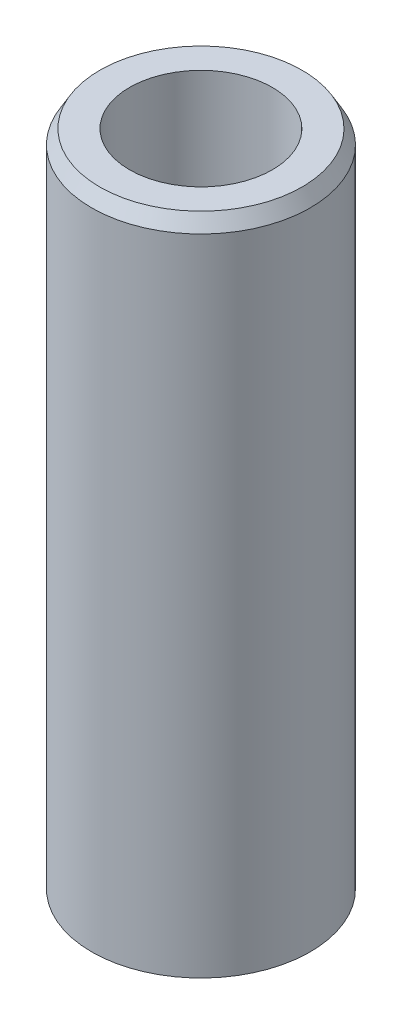
ISO-10303-21;
HEADER;
FILE_DESCRIPTION(('STEP AP214'),'2;1');
FILE_NAME('part.step','',(''),(''),'','','');
FILE_SCHEMA(('AUTOMOTIVE_DESIGN { 1 0 10303 214 1 1 1 1 }'));
ENDSEC;
DATA;
#1=APPLICATION_CONTEXT('core data for automotive mechanical design processes');
#2=APPLICATION_PROTOCOL_DEFINITION('international standard','automotive_design',2000,#1);
#3=PRODUCT_CONTEXT('',#1,'mechanical');
#4=PRODUCT('Part','Part','',(#3));
#5=PRODUCT_RELATED_PRODUCT_CATEGORY('part','',(#4));
#6=PRODUCT_DEFINITION_FORMATION('','',#4);
#7=PRODUCT_DEFINITION_CONTEXT('part definition',#1,'design');
#8=PRODUCT_DEFINITION('design','',#6,#7);
#9=PRODUCT_DEFINITION_SHAPE('','',#8);
#10=(LENGTH_UNIT() NAMED_UNIT(*) SI_UNIT(.MILLI.,.METRE.));
#11=(NAMED_UNIT(*) PLANE_ANGLE_UNIT() SI_UNIT($,.RADIAN.));
#12=(NAMED_UNIT(*) SI_UNIT($,.STERADIAN.) SOLID_ANGLE_UNIT());
#13=UNCERTAINTY_MEASURE_WITH_UNIT(LENGTH_MEASURE(1.E-05),#10,'distance_accuracy_value','');
#14=(GEOMETRIC_REPRESENTATION_CONTEXT(3) GLOBAL_UNCERTAINTY_ASSIGNED_CONTEXT((#13)) GLOBAL_UNIT_ASSIGNED_CONTEXT((#10,
#11,#12)) REPRESENTATION_CONTEXT('',''));
#15=CARTESIAN_POINT('',(0.,0.,0.));
#16=DIRECTION('',(0.,0.,1.));
#17=DIRECTION('',(1.,0.,0.));
#18=AXIS2_PLACEMENT_3D('',#15,#16,#17);
#19=CARTESIAN_POINT('',(0.,213.468186097187,0.));
#20=DIRECTION('',(0.,-1.,0.));
#21=DIRECTION('',(0.,0.,-1.));
#22=AXIS2_PLACEMENT_3D('',#19,#20,#21);
#23=CYLINDRICAL_SURFACE('',#22,35.);
#24=CARTESIAN_POINT('',(0.,208.973136825571,0.));
#25=DIRECTION('',(0.,1.,0.));
#26=DIRECTION('',(0.,0.,1.));
#27=AXIS2_PLACEMENT_3D('',#24,#25,#26);
#28=CIRCLE('',#27,35.);
#29=CARTESIAN_POINT('',(0.,208.973136825571,35.));
#30=VERTEX_POINT('',#29);
#31=EDGE_CURVE('E50',#30,#30,#28,.F.);
#32=ORIENTED_EDGE('',*,*,#31,.T.);
#33=EDGE_LOOP('',(#32));
#34=FACE_BOUND('',#33,.T.);
#35=CARTESIAN_POINT('',(0.,2.59521790698833,0.));
#36=DIRECTION('',(0.,1.,0.));
#37=DIRECTION('',(0.,0.,1.));
#38=AXIS2_PLACEMENT_3D('',#35,#36,#37);
#39=CIRCLE('',#38,35.);
#40=CARTESIAN_POINT('',(0.,2.59521790698833,35.));
#41=VERTEX_POINT('',#40);
#42=EDGE_CURVE('E51',#41,#41,#39,.T.);
#43=ORIENTED_EDGE('',*,*,#42,.T.);
#44=EDGE_LOOP('',(#43));
#45=FACE_BOUND('',#44,.T.);
#46=ADVANCED_FACE('F39',(#34,#45),#23,.T.);
#47=CARTESIAN_POINT('',(0.,213.468186097187,0.));
#48=DIRECTION('',(0.,1.,0.));
#49=DIRECTION('',(0.,0.,1.));
#50=AXIS2_PLACEMENT_3D('',#47,#48,#49);
#51=PLANE('',#50);
#52=CARTESIAN_POINT('',(0.,213.468186097187,0.));
#53=DIRECTION('',(0.,1.,0.));
#54=DIRECTION('',(0.,0.,1.));
#55=AXIS2_PLACEMENT_3D('',#52,#53,#54);
#56=CIRCLE('',#55,32.4047820930116);
#57=CARTESIAN_POINT('',(0.,213.468186097187,32.4047820930116));
#58=VERTEX_POINT('',#57);
#59=EDGE_CURVE('E54',#58,#58,#56,.T.);
#60=ORIENTED_EDGE('',*,*,#59,.T.);
#61=EDGE_LOOP('',(#60));
#62=FACE_BOUND('',#61,.T.);
#63=CARTESIAN_POINT('',(0.,213.468186097187,0.));
#64=DIRECTION('',(0.,1.,0.));
#65=DIRECTION('',(0.,0.,1.));
#66=AXIS2_PLACEMENT_3D('',#63,#64,#65);
#67=CIRCLE('',#66,22.874463983885);
#68=CARTESIAN_POINT('',(0.,213.468186097187,22.874463983885));
#69=VERTEX_POINT('',#68);
#70=EDGE_CURVE('E58',#69,#69,#67,.T.);
#71=ORIENTED_EDGE('',*,*,#70,.F.);
#72=EDGE_LOOP('',(#71));
#73=FACE_BOUND('',#72,.T.);
#74=ADVANCED_FACE('F69',(#62,#73),#51,.T.);
#75=CARTESIAN_POINT('',(0.,0.,0.));
#76=DIRECTION('',(0.,1.,0.));
#77=DIRECTION('',(0.,0.,1.));
#78=AXIS2_PLACEMENT_3D('',#75,#76,#77);
#79=PLANE('',#78);
#80=CARTESIAN_POINT('',(0.,0.,0.));
#81=DIRECTION('',(0.,1.,0.));
#82=DIRECTION('',(0.,0.,1.));
#83=AXIS2_PLACEMENT_3D('',#80,#81,#82);
#84=CIRCLE('',#83,30.5049507283836);
#85=CARTESIAN_POINT('',(0.,0.,30.5049507283836));
#86=VERTEX_POINT('',#85);
#87=EDGE_CURVE('E10',#86,#86,#84,.F.);
#88=ORIENTED_EDGE('',*,*,#87,.T.);
#89=EDGE_LOOP('',(#88));
#90=FACE_BOUND('',#89,.T.);
#91=CARTESIAN_POINT('',(0.,0.,0.));
#92=DIRECTION('',(0.,1.,0.));
#93=DIRECTION('',(0.,0.,1.));
#94=AXIS2_PLACEMENT_3D('',#91,#92,#93);
#95=CIRCLE('',#94,22.874463983885);
#96=CARTESIAN_POINT('',(0.,0.,22.874463983885));
#97=VERTEX_POINT('',#96);
#98=EDGE_CURVE('E63',#97,#97,#95,.T.);
#99=ORIENTED_EDGE('',*,*,#98,.T.);
#100=EDGE_LOOP('',(#99));
#101=FACE_BOUND('',#100,.T.);
#102=ADVANCED_FACE('F75',(#90,#101),#79,.F.);
#103=CARTESIAN_POINT('',(0.,213.468186097187,0.));
#104=DIRECTION('',(0.,-1.,0.));
#105=DIRECTION('',(0.,0.,-1.));
#106=AXIS2_PLACEMENT_3D('',#103,#104,#105);
#107=CYLINDRICAL_SURFACE('',#106,22.874463983885);
#108=ORIENTED_EDGE('',*,*,#70,.T.);
#109=EDGE_LOOP('',(#108));
#110=FACE_BOUND('',#109,.T.);
#111=ORIENTED_EDGE('',*,*,#98,.F.);
#112=EDGE_LOOP('',(#111));
#113=FACE_BOUND('',#112,.T.);
#114=ADVANCED_FACE('F70',(#110,#113),#107,.F.);
#115=CARTESIAN_POINT('',(0.,213.468186097187,0.));
#116=DIRECTION('',(0.,-1.,0.));
#117=DIRECTION('',(0.,0.,-1.));
#118=AXIS2_PLACEMENT_3D('',#115,#116,#117);
#119=CONICAL_SURFACE('',#118,32.4047820930116,0.523598775598297);
#120=ORIENTED_EDGE('',*,*,#31,.F.);
#121=EDGE_LOOP('',(#120));
#122=FACE_BOUND('',#121,.T.);
#123=ORIENTED_EDGE('',*,*,#59,.F.);
#124=EDGE_LOOP('',(#123));
#125=FACE_BOUND('',#124,.T.);
#126=ADVANCED_FACE('F81',(#122,#125),#119,.T.);
#127=CARTESIAN_POINT('',(0.,2.59521790698833,0.));
#128=DIRECTION('',(0.,1.,0.));
#129=DIRECTION('',(0.,0.,1.));
#130=AXIS2_PLACEMENT_3D('',#127,#128,#129);
#131=CONICAL_SURFACE('',#130,35.,1.0471975511966);
#132=ORIENTED_EDGE('',*,*,#87,.F.);
#133=EDGE_LOOP('',(#132));
#134=FACE_BOUND('',#133,.T.);
#135=ORIENTED_EDGE('',*,*,#42,.F.);
#136=EDGE_LOOP('',(#135));
#137=FACE_BOUND('',#136,.T.);
#138=ADVANCED_FACE('F45',(#134,#137),#131,.T.);
#139=CLOSED_SHELL('',(#46,#74,#102,#114,#126,#138));
#140=MANIFOLD_SOLID_BREP('B2',#139);
#141=ADVANCED_BREP_SHAPE_REPRESENTATION('',(#18,#140),#14);
#142=SHAPE_DEFINITION_REPRESENTATION(#9,#141);
ENDSEC;
END-ISO-10303-21;
